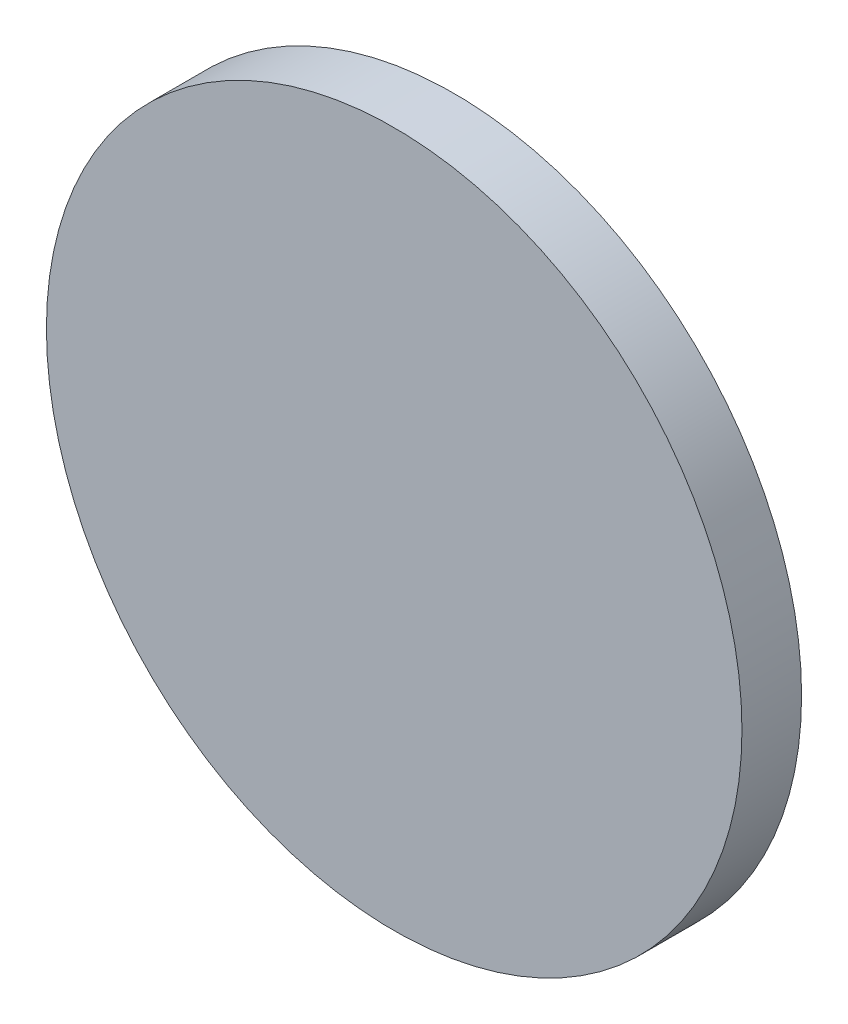
ISO-10303-21;
HEADER;
FILE_DESCRIPTION(('STEP AP214'),'2;1');
FILE_NAME('part.step','',(''),(''),'','','');
FILE_SCHEMA(('AUTOMOTIVE_DESIGN { 1 0 10303 214 1 1 1 1 }'));
ENDSEC;
DATA;
#1=APPLICATION_CONTEXT('core data for automotive mechanical design processes');
#2=APPLICATION_PROTOCOL_DEFINITION('international standard','automotive_design',2000,#1);
#3=PRODUCT_CONTEXT('',#1,'mechanical');
#4=PRODUCT('Part','Part','',(#3));
#5=PRODUCT_RELATED_PRODUCT_CATEGORY('part','',(#4));
#6=PRODUCT_DEFINITION_FORMATION('','',#4);
#7=PRODUCT_DEFINITION_CONTEXT('part definition',#1,'design');
#8=PRODUCT_DEFINITION('design','',#6,#7);
#9=PRODUCT_DEFINITION_SHAPE('','',#8);
#10=(LENGTH_UNIT() NAMED_UNIT(*) SI_UNIT(.MILLI.,.METRE.));
#11=(NAMED_UNIT(*) PLANE_ANGLE_UNIT() SI_UNIT($,.RADIAN.));
#12=(NAMED_UNIT(*) SI_UNIT($,.STERADIAN.) SOLID_ANGLE_UNIT());
#13=UNCERTAINTY_MEASURE_WITH_UNIT(LENGTH_MEASURE(1.E-05),#10,'distance_accuracy_value','');
#14=(GEOMETRIC_REPRESENTATION_CONTEXT(3) GLOBAL_UNCERTAINTY_ASSIGNED_CONTEXT((#13)) GLOBAL_UNIT_ASSIGNED_CONTEXT((#10,
#11,#12)) REPRESENTATION_CONTEXT('',''));
#15=CARTESIAN_POINT('',(0.,0.,0.));
#16=DIRECTION('',(0.,0.,1.));
#17=DIRECTION('',(1.,0.,0.));
#18=AXIS2_PLACEMENT_3D('',#15,#16,#17);
#19=CARTESIAN_POINT('',(1.651,8.477250006176,0.03429));
#20=DIRECTION('',(0.,0.,1.));
#21=DIRECTION('',(1.,0.,0.));
#22=AXIS2_PLACEMENT_3D('',#19,#20,#21);
#23=PLANE('',#22);
#24=CARTESIAN_POINT('',(1.651,8.477250006176,0.03429));
#25=DIRECTION('',(0.,0.,1.));
#26=DIRECTION('',(1.,0.,0.));
#27=AXIS2_PLACEMENT_3D('',#24,#25,#26);
#28=CIRCLE('',#27,0.200024667);
#29=CARTESIAN_POINT('',(1.851024667,8.477250006176,0.03429));
#30=VERTEX_POINT('',#29);
#31=EDGE_CURVE('E18',#30,#30,#28,.F.);
#32=ORIENTED_EDGE('',*,*,#31,.F.);
#33=EDGE_LOOP('',(#32));
#34=FACE_BOUND('',#33,.T.);
#35=ADVANCED_FACE('F15',(#34),#23,.T.);
#36=CARTESIAN_POINT('',(1.651,8.477250006176,0.));
#37=DIRECTION('',(0.,0.,1.));
#38=DIRECTION('',(1.,0.,0.));
#39=AXIS2_PLACEMENT_3D('',#36,#37,#38);
#40=CYLINDRICAL_SURFACE('',#39,0.200024667);
#41=ORIENTED_EDGE('',*,*,#31,.T.);
#42=EDGE_LOOP('',(#41));
#43=FACE_BOUND('',#42,.T.);
#44=CARTESIAN_POINT('',(1.651,8.477250006176,0.));
#45=DIRECTION('',(0.,0.,1.));
#46=DIRECTION('',(1.,0.,0.));
#47=AXIS2_PLACEMENT_3D('',#44,#45,#46);
#48=CIRCLE('',#47,0.200024667);
#49=CARTESIAN_POINT('',(1.851024667,8.477250006176,0.));
#50=VERTEX_POINT('',#49);
#51=EDGE_CURVE('E10',#50,#50,#48,.F.);
#52=ORIENTED_EDGE('',*,*,#51,.F.);
#53=EDGE_LOOP('',(#52));
#54=FACE_BOUND('',#53,.T.);
#55=ADVANCED_FACE('F27',(#43,#54),#40,.T.);
#56=CARTESIAN_POINT('',(1.651,8.477250006176,0.));
#57=DIRECTION('',(0.,0.,-1.));
#58=DIRECTION('',(-1.,0.,0.));
#59=AXIS2_PLACEMENT_3D('',#56,#57,#58);
#60=PLANE('',#59);
#61=ORIENTED_EDGE('',*,*,#51,.T.);
#62=EDGE_LOOP('',(#61));
#63=FACE_BOUND('',#62,.T.);
#64=ADVANCED_FACE('F35',(#63),#60,.T.);
#65=CLOSED_SHELL('',(#35,#55,#64));
#66=MANIFOLD_SOLID_BREP('B1',#65);
#67=ADVANCED_BREP_SHAPE_REPRESENTATION('',(#18,#66),#14);
#68=SHAPE_DEFINITION_REPRESENTATION(#9,#67);
ENDSEC;
END-ISO-10303-21;
